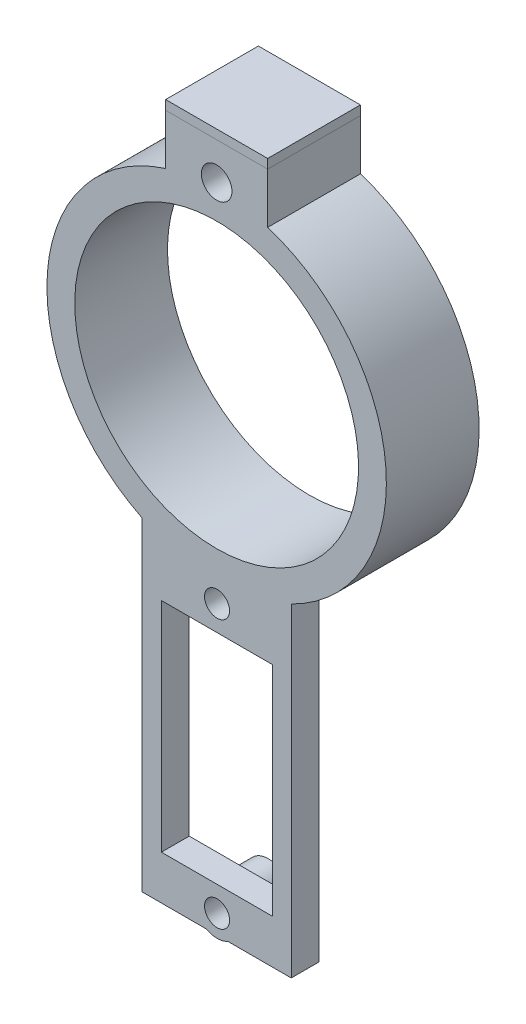
ISO-10303-21;
HEADER;
FILE_DESCRIPTION(('STEP AP214'),'2;1');
FILE_NAME('part.step','',(''),(''),'','','');
FILE_SCHEMA(('AUTOMOTIVE_DESIGN { 1 0 10303 214 1 1 1 1 }'));
ENDSEC;
DATA;
#1=APPLICATION_CONTEXT('core data for automotive mechanical design processes');
#2=APPLICATION_PROTOCOL_DEFINITION('international standard','automotive_design',2000,#1);
#3=PRODUCT_CONTEXT('',#1,'mechanical');
#4=PRODUCT('Part','Part','',(#3));
#5=PRODUCT_RELATED_PRODUCT_CATEGORY('part','',(#4));
#6=PRODUCT_DEFINITION_FORMATION('','',#4);
#7=PRODUCT_DEFINITION_CONTEXT('part definition',#1,'design');
#8=PRODUCT_DEFINITION('design','',#6,#7);
#9=PRODUCT_DEFINITION_SHAPE('','',#8);
#10=(LENGTH_UNIT() NAMED_UNIT(*) SI_UNIT(.MILLI.,.METRE.));
#11=(NAMED_UNIT(*) PLANE_ANGLE_UNIT() SI_UNIT($,.RADIAN.));
#12=(NAMED_UNIT(*) SI_UNIT($,.STERADIAN.) SOLID_ANGLE_UNIT());
#13=UNCERTAINTY_MEASURE_WITH_UNIT(LENGTH_MEASURE(1.E-05),#10,'distance_accuracy_value','');
#14=(GEOMETRIC_REPRESENTATION_CONTEXT(3) GLOBAL_UNCERTAINTY_ASSIGNED_CONTEXT((#13)) GLOBAL_UNIT_ASSIGNED_CONTEXT((#10,
#11,#12)) REPRESENTATION_CONTEXT('',''));
#15=CARTESIAN_POINT('',(0.,0.,0.));
#16=DIRECTION('',(0.,0.,1.));
#17=DIRECTION('',(1.,0.,0.));
#18=AXIS2_PLACEMENT_3D('',#15,#16,#17);
#19=CARTESIAN_POINT('',(5.49999999999999,23.8942942095287,10.));
#20=DIRECTION('',(-1.,0.,0.));
#21=DIRECTION('',(0.,0.,1.));
#22=AXIS2_PLACEMENT_3D('',#19,#20,#21);
#23=PLANE('',#22);
#24=DIRECTION('',(0.,0.,-1.));
#25=VECTOR('',#24,1.);
#26=CARTESIAN_POINT('',(5.49999999999999,22.8942942095287,10.));
#27=LINE('',#26,#25);
#28=CARTESIAN_POINT('',(5.49999999999999,22.8942942095287,10.));
#29=VERTEX_POINT('',#28);
#30=CARTESIAN_POINT('',(5.49999999999999,22.8942942095287,0.));
#31=VERTEX_POINT('',#30);
#32=EDGE_CURVE('E104',#29,#31,#27,.T.);
#33=ORIENTED_EDGE('',*,*,#32,.T.);
#34=DIRECTION('',(0.,-1.,0.));
#35=VECTOR('',#34,1.);
#36=CARTESIAN_POINT('',(5.49999999999999,23.8942942095287,0.));
#37=LINE('',#36,#35);
#38=CARTESIAN_POINT('',(5.49999999999999,23.8942942095287,0.));
#39=VERTEX_POINT('',#38);
#40=EDGE_CURVE('E12',#39,#31,#37,.T.);
#41=ORIENTED_EDGE('',*,*,#40,.F.);
#42=DIRECTION('',(0.,0.,-1.));
#43=VECTOR('',#42,1.);
#44=CARTESIAN_POINT('',(5.49999999999999,23.8942942095287,10.));
#45=LINE('',#44,#43);
#46=CARTESIAN_POINT('',(5.49999999999999,23.8942942095287,10.));
#47=VERTEX_POINT('',#46);
#48=EDGE_CURVE('E92',#47,#39,#45,.T.);
#49=ORIENTED_EDGE('',*,*,#48,.F.);
#50=DIRECTION('',(0.,-1.,0.));
#51=VECTOR('',#50,1.);
#52=CARTESIAN_POINT('',(5.49999999999999,23.8942942095287,10.));
#53=LINE('',#52,#51);
#54=EDGE_CURVE('E100',#47,#29,#53,.T.);
#55=ORIENTED_EDGE('',*,*,#54,.T.);
#56=EDGE_LOOP('',(#33,#41,#49,#55));
#57=FACE_BOUND('',#56,.T.);
#58=ADVANCED_FACE('F41',(#57),#23,.F.);
#59=CARTESIAN_POINT('',(5.49999999999999,23.8942942095287,0.));
#60=DIRECTION('',(0.,0.,1.));
#61=DIRECTION('',(1.,0.,0.));
#62=AXIS2_PLACEMENT_3D('',#59,#60,#61);
#63=PLANE('',#62);
#64=DIRECTION('',(-1.,0.,0.));
#65=VECTOR('',#64,1.);
#66=CARTESIAN_POINT('',(5.49999999999999,22.8942942095287,0.));
#67=LINE('',#66,#65);
#68=CARTESIAN_POINT('',(-5.5,22.8942942095287,0.));
#69=VERTEX_POINT('',#68);
#70=EDGE_CURVE('E96',#31,#69,#67,.T.);
#71=ORIENTED_EDGE('',*,*,#70,.T.);
#72=DIRECTION('',(0.,-1.,0.));
#73=VECTOR('',#72,1.);
#74=CARTESIAN_POINT('',(-5.5,23.8942942095287,0.));
#75=LINE('',#74,#73);
#76=CARTESIAN_POINT('',(-5.5,23.8942942095287,0.));
#77=VERTEX_POINT('',#76);
#78=EDGE_CURVE('E49',#77,#69,#75,.T.);
#79=ORIENTED_EDGE('',*,*,#78,.F.);
#80=DIRECTION('',(-1.,0.,0.));
#81=VECTOR('',#80,1.);
#82=CARTESIAN_POINT('',(5.49999999999999,23.8942942095287,0.));
#83=LINE('',#82,#81);
#84=EDGE_CURVE('E87',#39,#77,#83,.T.);
#85=ORIENTED_EDGE('',*,*,#84,.F.);
#86=ORIENTED_EDGE('',*,*,#40,.T.);
#87=EDGE_LOOP('',(#71,#79,#85,#86));
#88=FACE_BOUND('',#87,.T.);
#89=ADVANCED_FACE('F95',(#88),#63,.F.);
#90=CARTESIAN_POINT('',(-5.5,23.8942942095287,10.));
#91=DIRECTION('',(1.,0.,0.));
#92=DIRECTION('',(0.,0.,-1.));
#93=AXIS2_PLACEMENT_3D('',#90,#91,#92);
#94=PLANE('',#93);
#95=DIRECTION('',(0.,0.,1.));
#96=VECTOR('',#95,1.);
#97=CARTESIAN_POINT('',(-5.5,22.8942942095287,10.));
#98=LINE('',#97,#96);
#99=CARTESIAN_POINT('',(-5.5,22.8942942095287,10.));
#100=VERTEX_POINT('',#99);
#101=EDGE_CURVE('E74',#69,#100,#98,.T.);
#102=ORIENTED_EDGE('',*,*,#101,.T.);
#103=DIRECTION('',(0.,-1.,0.));
#104=VECTOR('',#103,1.);
#105=CARTESIAN_POINT('',(-5.5,23.8942942095287,10.));
#106=LINE('',#105,#104);
#107=CARTESIAN_POINT('',(-5.5,23.8942942095287,10.));
#108=VERTEX_POINT('',#107);
#109=EDGE_CURVE('E97',#108,#100,#106,.T.);
#110=ORIENTED_EDGE('',*,*,#109,.F.);
#111=DIRECTION('',(0.,0.,1.));
#112=VECTOR('',#111,1.);
#113=CARTESIAN_POINT('',(-5.5,23.8942942095287,10.));
#114=LINE('',#113,#112);
#115=EDGE_CURVE('E90',#77,#108,#114,.T.);
#116=ORIENTED_EDGE('',*,*,#115,.F.);
#117=ORIENTED_EDGE('',*,*,#78,.T.);
#118=EDGE_LOOP('',(#102,#110,#116,#117));
#119=FACE_BOUND('',#118,.T.);
#120=ADVANCED_FACE('F98',(#119),#94,.F.);
#121=CARTESIAN_POINT('',(5.49999999999999,23.8942942095287,10.));
#122=DIRECTION('',(0.,0.,-1.));
#123=DIRECTION('',(-1.,0.,0.));
#124=AXIS2_PLACEMENT_3D('',#121,#122,#123);
#125=PLANE('',#124);
#126=DIRECTION('',(1.,0.,0.));
#127=VECTOR('',#126,1.);
#128=CARTESIAN_POINT('',(5.49999999999999,22.8942942095287,10.));
#129=LINE('',#128,#127);
#130=EDGE_CURVE('E80',#100,#29,#129,.T.);
#131=ORIENTED_EDGE('',*,*,#130,.T.);
#132=ORIENTED_EDGE('',*,*,#54,.F.);
#133=DIRECTION('',(1.,0.,0.));
#134=VECTOR('',#133,1.);
#135=CARTESIAN_POINT('',(5.49999999999999,23.8942942095287,10.));
#136=LINE('',#135,#134);
#137=EDGE_CURVE('E57',#108,#47,#136,.T.);
#138=ORIENTED_EDGE('',*,*,#137,.F.);
#139=ORIENTED_EDGE('',*,*,#109,.T.);
#140=EDGE_LOOP('',(#131,#132,#138,#139));
#141=FACE_BOUND('',#140,.T.);
#142=ADVANCED_FACE('F111',(#141),#125,.F.);
#143=CARTESIAN_POINT('',(5.49999999999999,23.8942942095287,0.));
#144=DIRECTION('',(0.,1.,0.));
#145=DIRECTION('',(0.,0.,1.));
#146=AXIS2_PLACEMENT_3D('',#143,#144,#145);
#147=PLANE('',#146);
#148=ORIENTED_EDGE('',*,*,#48,.T.);
#149=ORIENTED_EDGE('',*,*,#84,.T.);
#150=ORIENTED_EDGE('',*,*,#115,.T.);
#151=ORIENTED_EDGE('',*,*,#137,.T.);
#152=EDGE_LOOP('',(#148,#149,#150,#151));
#153=FACE_BOUND('',#152,.T.);
#154=ADVANCED_FACE('F88',(#153),#147,.T.);
#155=CARTESIAN_POINT('',(5.49999999999999,22.8942942095287,0.));
#156=DIRECTION('',(0.,1.,0.));
#157=DIRECTION('',(0.,0.,1.));
#158=AXIS2_PLACEMENT_3D('',#155,#156,#157);
#159=PLANE('',#158);
#160=ORIENTED_EDGE('',*,*,#32,.F.);
#161=ORIENTED_EDGE('',*,*,#130,.F.);
#162=ORIENTED_EDGE('',*,*,#101,.F.);
#163=ORIENTED_EDGE('',*,*,#70,.F.);
#164=EDGE_LOOP('',(#160,#161,#162,#163));
#165=FACE_BOUND('',#164,.T.);
#166=ADVANCED_FACE('F114',(#165),#159,.F.);
#167=CLOSED_SHELL('',(#58,#89,#120,#142,#154,#166));
#168=MANIFOLD_SOLID_BREP('B2',#167);
#169=CARTESIAN_POINT('',(-8.04395604395605,-51.3630681719536,7.));
#170=DIRECTION('',(0.,-1.,0.));
#171=DIRECTION('',(0.,0.,-1.));
#172=AXIS2_PLACEMENT_3D('',#169,#170,#171);
#173=PLANE('',#172);
#174=DIRECTION('',(0.,0.,1.));
#175=VECTOR('',#174,1.);
#176=CARTESIAN_POINT('',(1.19541252552043,-51.3630681719536,4.5));
#177=LINE('',#176,#175);
#178=CARTESIAN_POINT('',(1.19541252552043,-51.3630681719536,7.));
#179=VERTEX_POINT('',#178);
#180=CARTESIAN_POINT('',(1.19541252552043,-51.3630681719536,10.));
#181=VERTEX_POINT('',#180);
#182=EDGE_CURVE('E39',#179,#181,#177,.T.);
#183=ORIENTED_EDGE('',*,*,#182,.F.);
#184=DIRECTION('',(1.,0.,0.));
#185=VECTOR('',#184,1.);
#186=CARTESIAN_POINT('',(-8.04395604395605,-51.3630681719536,7.));
#187=LINE('',#186,#185);
#188=CARTESIAN_POINT('',(8.04395604395605,-51.3630681719536,7.));
#189=VERTEX_POINT('',#188);
#190=EDGE_CURVE('E486',#179,#189,#187,.T.);
#191=ORIENTED_EDGE('',*,*,#190,.T.);
#192=DIRECTION('',(0.,0.,1.));
#193=VECTOR('',#192,1.);
#194=CARTESIAN_POINT('',(8.04395604395605,-51.3630681719536,7.));
#195=LINE('',#194,#193);
#196=CARTESIAN_POINT('',(8.04395604395605,-51.3630681719536,10.));
#197=VERTEX_POINT('',#196);
#198=EDGE_CURVE('E342',#189,#197,#195,.T.);
#199=ORIENTED_EDGE('',*,*,#198,.T.);
#200=DIRECTION('',(1.,0.,0.));
#201=VECTOR('',#200,1.);
#202=CARTESIAN_POINT('',(-8.04395604395605,-51.3630681719536,10.));
#203=LINE('',#202,#201);
#204=EDGE_CURVE('E328',#181,#197,#203,.T.);
#205=ORIENTED_EDGE('',*,*,#204,.F.);
#206=EDGE_LOOP('',(#183,#191,#199,#205));
#207=FACE_BOUND('',#206,.T.);
#208=ADVANCED_FACE('F165',(#207),#173,.T.);
#209=CARTESIAN_POINT('',(0.,0.,10.));
#210=DIRECTION('',(0.,0.,-1.));
#211=DIRECTION('',(-1.,0.,0.));
#212=AXIS2_PLACEMENT_3D('',#209,#210,#211);
#213=CYLINDRICAL_SURFACE('',#212,18.3);
#214=CARTESIAN_POINT('',(0.,0.,4.5));
#215=DIRECTION('',(0.,0.,1.));
#216=DIRECTION('',(1.,0.,0.));
#217=AXIS2_PLACEMENT_3D('',#214,#215,#216);
#218=CIRCLE('',#217,18.3);
#219=CARTESIAN_POINT('',(-0.933853262683011,-18.2761570928841,4.5));
#220=VERTEX_POINT('',#219);
#221=CARTESIAN_POINT('',(1.01255338187159,-18.2719658397464,4.5));
#222=VERTEX_POINT('',#221);
#223=EDGE_CURVE('E322',#220,#222,#218,.T.);
#224=ORIENTED_EDGE('',*,*,#223,.F.);
#225=DIRECTION('',(0.,0.,1.));
#226=VECTOR('',#225,1.);
#227=CARTESIAN_POINT('',(-0.933853262683006,-18.2761570928841,7.25));
#228=LINE('',#227,#226);
#229=CARTESIAN_POINT('',(-0.933853262683004,-18.2761570928841,7.));
#230=VERTEX_POINT('',#229);
#231=EDGE_CURVE('E385',#220,#230,#228,.T.);
#232=ORIENTED_EDGE('',*,*,#231,.T.);
#233=CARTESIAN_POINT('',(0.,0.,7.));
#234=DIRECTION('',(0.,0.,1.));
#235=DIRECTION('',(1.,0.,0.));
#236=AXIS2_PLACEMENT_3D('',#233,#234,#235);
#237=CIRCLE('',#236,18.3);
#238=CARTESIAN_POINT('',(-8.04395604395604,-16.4372981710165,7.));
#239=VERTEX_POINT('',#238);
#240=EDGE_CURVE('E360',#239,#230,#237,.T.);
#241=ORIENTED_EDGE('',*,*,#240,.F.);
#242=DIRECTION('',(0.,0.,1.));
#243=VECTOR('',#242,1.);
#244=CARTESIAN_POINT('',(-8.04395604395604,-16.4372981710165,7.));
#245=LINE('',#244,#243);
#246=CARTESIAN_POINT('',(-8.04395604395604,-16.4372981710165,10.));
#247=VERTEX_POINT('',#246);
#248=EDGE_CURVE('E335',#239,#247,#245,.T.);
#249=ORIENTED_EDGE('',*,*,#248,.T.);
#250=CARTESIAN_POINT('',(0.,0.,10.));
#251=DIRECTION('',(0.,0.,1.));
#252=DIRECTION('',(1.,0.,0.));
#253=AXIS2_PLACEMENT_3D('',#250,#251,#252);
#254=CIRCLE('',#253,18.3);
#255=CARTESIAN_POINT('',(-5.5,17.4539393834171,10.));
#256=VERTEX_POINT('',#255);
#257=EDGE_CURVE('E358',#256,#247,#254,.T.);
#258=ORIENTED_EDGE('',*,*,#257,.F.);
#259=DIRECTION('',(0.,0.,-1.));
#260=VECTOR('',#259,1.);
#261=CARTESIAN_POINT('',(-5.5,17.4539393834171,10.));
#262=LINE('',#261,#260);
#263=CARTESIAN_POINT('',(-5.5,17.4539393834171,0.));
#264=VERTEX_POINT('',#263);
#265=EDGE_CURVE('E440',#256,#264,#262,.T.);
#266=ORIENTED_EDGE('',*,*,#265,.T.);
#267=CARTESIAN_POINT('',(0.,0.,0.));
#268=DIRECTION('',(0.,0.,1.));
#269=DIRECTION('',(1.,0.,0.));
#270=AXIS2_PLACEMENT_3D('',#267,#268,#269);
#271=CIRCLE('',#270,18.3);
#272=CARTESIAN_POINT('',(5.5,17.4539393834171,0.));
#273=VERTEX_POINT('',#272);
#274=EDGE_CURVE('E351',#264,#273,#271,.T.);
#275=ORIENTED_EDGE('',*,*,#274,.T.);
#276=DIRECTION('',(0.,0.,-1.));
#277=VECTOR('',#276,1.);
#278=CARTESIAN_POINT('',(5.5,17.4539393834171,10.));
#279=LINE('',#278,#277);
#280=CARTESIAN_POINT('',(5.5,17.4539393834171,10.));
#281=VERTEX_POINT('',#280);
#282=EDGE_CURVE('E416',#281,#273,#279,.T.);
#283=ORIENTED_EDGE('',*,*,#282,.F.);
#284=CARTESIAN_POINT('',(8.04395604395603,-16.4372981710165,10.));
#285=VERTEX_POINT('',#284);
#286=EDGE_CURVE('E354',#285,#281,#254,.T.);
#287=ORIENTED_EDGE('',*,*,#286,.F.);
#288=DIRECTION('',(0.,0.,1.));
#289=VECTOR('',#288,1.);
#290=CARTESIAN_POINT('',(8.04395604395604,-16.4372981710165,7.));
#291=LINE('',#290,#289);
#292=CARTESIAN_POINT('',(8.04395604395604,-16.4372981710165,7.));
#293=VERTEX_POINT('',#292);
#294=EDGE_CURVE('E339',#293,#285,#291,.T.);
#295=ORIENTED_EDGE('',*,*,#294,.F.);
#296=CARTESIAN_POINT('',(1.01255338187159,-18.2719658397464,7.));
#297=VERTEX_POINT('',#296);
#298=EDGE_CURVE('E357',#297,#293,#237,.T.);
#299=ORIENTED_EDGE('',*,*,#298,.F.);
#300=DIRECTION('',(0.,0.,1.));
#301=VECTOR('',#300,1.);
#302=CARTESIAN_POINT('',(1.01255338187159,-18.2719658397464,7.25));
#303=LINE('',#302,#301);
#304=EDGE_CURVE('E187',#297,#222,#303,.F.);
#305=ORIENTED_EDGE('',*,*,#304,.T.);
#306=EDGE_LOOP('',(#224,#232,#241,#249,#258,#266,#275,#283,#287,#295,#299,#305));
#307=FACE_BOUND('',#306,.T.);
#308=ADVANCED_FACE('F167',(#307),#213,.T.);
#309=CARTESIAN_POINT('',(3.5,18.3,10.));
#310=DIRECTION('',(1.,0.,0.));
#311=DIRECTION('',(0.,1.,0.));
#312=AXIS2_PLACEMENT_3D('',#309,#310,#311);
#313=PLANE('',#312);
#314=DIRECTION('',(0.,0.,-1.));
#315=VECTOR('',#314,1.);
#316=CARTESIAN_POINT('',(3.5,14.8942942095287,10.));
#317=LINE('',#316,#315);
#318=CARTESIAN_POINT('',(3.50000000000001,14.8942942095287,10.));
#319=VERTEX_POINT('',#318);
#320=CARTESIAN_POINT('',(3.5,14.8942942095287,0.));
#321=VERTEX_POINT('',#320);
#322=EDGE_CURVE('E447',#319,#321,#317,.T.);
#323=ORIENTED_EDGE('',*,*,#322,.F.);
#324=DIRECTION('',(0.,0.624695047554424,-0.78086880944303));
#325=VECTOR('',#324,1.);
#326=CARTESIAN_POINT('',(3.5,14.8942942095287,10.));
#327=LINE('',#326,#325);
#328=CARTESIAN_POINT('',(3.5,22.8942942095287,0.));
#329=VERTEX_POINT('',#328);
#330=EDGE_CURVE('E422',#319,#329,#327,.T.);
#331=ORIENTED_EDGE('',*,*,#330,.T.);
#332=DIRECTION('',(0.,-1.,0.));
#333=VECTOR('',#332,1.);
#334=CARTESIAN_POINT('',(3.5,18.3,0.));
#335=LINE('',#334,#333);
#336=EDGE_CURVE('E442',#329,#321,#335,.T.);
#337=ORIENTED_EDGE('',*,*,#336,.T.);
#338=EDGE_LOOP('',(#323,#331,#337));
#339=FACE_BOUND('',#338,.T.);
#340=ADVANCED_FACE('F518',(#339),#313,.F.);
#341=CARTESIAN_POINT('',(-3.5,18.3,10.));
#342=DIRECTION('',(-1.,0.,0.));
#343=DIRECTION('',(0.,-1.,0.));
#344=AXIS2_PLACEMENT_3D('',#341,#342,#343);
#345=PLANE('',#344);
#346=DIRECTION('',(0.,0.624695047554424,-0.78086880944303));
#347=VECTOR('',#346,1.);
#348=CARTESIAN_POINT('',(-3.5,14.8942942095287,10.));
#349=LINE('',#348,#347);
#350=CARTESIAN_POINT('',(-3.5,14.8942942095287,10.));
#351=VERTEX_POINT('',#350);
#352=CARTESIAN_POINT('',(-3.5,22.8942942095287,0.));
#353=VERTEX_POINT('',#352);
#354=EDGE_CURVE('E419',#351,#353,#349,.T.);
#355=ORIENTED_EDGE('',*,*,#354,.F.);
#356=DIRECTION('',(0.,0.,-1.));
#357=VECTOR('',#356,1.);
#358=CARTESIAN_POINT('',(-3.5,14.8942942095287,10.));
#359=LINE('',#358,#357);
#360=CARTESIAN_POINT('',(-3.5,14.8942942095287,0.));
#361=VERTEX_POINT('',#360);
#362=EDGE_CURVE('E448',#351,#361,#359,.T.);
#363=ORIENTED_EDGE('',*,*,#362,.T.);
#364=DIRECTION('',(0.,1.,0.));
#365=VECTOR('',#364,1.);
#366=CARTESIAN_POINT('',(-3.5,18.3,0.));
#367=LINE('',#366,#365);
#368=EDGE_CURVE('E444',#361,#353,#367,.T.);
#369=ORIENTED_EDGE('',*,*,#368,.T.);
#370=EDGE_LOOP('',(#355,#363,#369));
#371=FACE_BOUND('',#370,.T.);
#372=ADVANCED_FACE('F527',(#371),#345,.F.);
#373=CARTESIAN_POINT('',(0.,0.,10.));
#374=DIRECTION('',(0.,0.,1.));
#375=DIRECTION('',(1.,0.,0.));
#376=AXIS2_PLACEMENT_3D('',#373,#374,#375);
#377=PLANE('',#376);
#378=CARTESIAN_POINT('',(0.043956043956039,-20.4130681719536,10.));
#379=DIRECTION('',(0.,0.,1.));
#380=DIRECTION('',(1.,0.,0.));
#381=AXIS2_PLACEMENT_3D('',#378,#379,#380);
#382=CIRCLE('',#381,1.35);
#383=CARTESIAN_POINT('',(1.39395604395604,-20.4130681719536,10.));
#384=VERTEX_POINT('',#383);
#385=EDGE_CURVE('E547',#384,#384,#382,.T.);
#386=ORIENTED_EDGE('',*,*,#385,.F.);
#387=EDGE_LOOP('',(#386));
#388=FACE_BOUND('',#387,.T.);
#389=CARTESIAN_POINT('',(0.0465021382288992,-49.3130669714726,10.));
#390=DIRECTION('',(0.,0.,1.));
#391=DIRECTION('',(1.,0.,0.));
#392=AXIS2_PLACEMENT_3D('',#389,#390,#391);
#393=CIRCLE('',#392,1.35);
#394=CARTESIAN_POINT('',(1.3965021382289,-49.3130669714726,10.));
#395=VERTEX_POINT('',#394);
#396=EDGE_CURVE('E541',#395,#395,#393,.T.);
#397=ORIENTED_EDGE('',*,*,#396,.F.);
#398=EDGE_LOOP('',(#397));
#399=FACE_BOUND('',#398,.T.);
#400=CARTESIAN_POINT('',(-8.04395604395605,-51.3630681719536,10.));
#401=VERTEX_POINT('',#400);
#402=CARTESIAN_POINT('',(-1.10240824906264,-51.3630681719536,10.));
#403=VERTEX_POINT('',#402);
#404=EDGE_CURVE('E318',#401,#403,#203,.T.);
#405=ORIENTED_EDGE('',*,*,#404,.T.);
#406=CARTESIAN_POINT('',(0.0465021382288992,-49.3130669714726,10.));
#407=DIRECTION('',(0.,0.,1.));
#408=DIRECTION('',(1.,0.,0.));
#409=AXIS2_PLACEMENT_3D('',#406,#407,#408);
#410=CIRCLE('',#409,2.35);
#411=EDGE_CURVE('E180',#403,#181,#410,.T.);
#412=ORIENTED_EDGE('',*,*,#411,.T.);
#413=ORIENTED_EDGE('',*,*,#204,.T.);
#414=DIRECTION('',(0.,1.,0.));
#415=VECTOR('',#414,1.);
#416=CARTESIAN_POINT('',(8.04395604395605,-51.3630681719536,10.));
#417=LINE('',#416,#415);
#418=EDGE_CURVE('E327',#197,#285,#417,.T.);
#419=ORIENTED_EDGE('',*,*,#418,.T.);
#420=ORIENTED_EDGE('',*,*,#286,.T.);
#421=DIRECTION('',(0.,-1.,0.));
#422=VECTOR('',#421,1.);
#423=CARTESIAN_POINT('',(5.5,22.8942942095287,10.));
#424=LINE('',#423,#422);
#425=CARTESIAN_POINT('',(5.5,22.8942942095287,10.));
#426=VERTEX_POINT('',#425);
#427=EDGE_CURVE('E410',#426,#281,#424,.T.);
#428=ORIENTED_EDGE('',*,*,#427,.F.);
#429=DIRECTION('',(1.,0.,0.));
#430=VECTOR('',#429,1.);
#431=CARTESIAN_POINT('',(-5.5,22.8942942095287,10.));
#432=LINE('',#431,#430);
#433=CARTESIAN_POINT('',(-5.5,22.8942942095287,10.));
#434=VERTEX_POINT('',#433);
#435=EDGE_CURVE('E438',#434,#426,#432,.T.);
#436=ORIENTED_EDGE('',*,*,#435,.F.);
#437=DIRECTION('',(0.,1.,0.));
#438=VECTOR('',#437,1.);
#439=CARTESIAN_POINT('',(-5.5,22.8942942095287,10.));
#440=LINE('',#439,#438);
#441=EDGE_CURVE('E431',#256,#434,#440,.T.);
#442=ORIENTED_EDGE('',*,*,#441,.F.);
#443=ORIENTED_EDGE('',*,*,#257,.T.);
#444=DIRECTION('',(0.,-1.,0.));
#445=VECTOR('',#444,1.);
#446=CARTESIAN_POINT('',(-8.04395604395604,-16.4372981710165,10.));
#447=LINE('',#446,#445);
#448=EDGE_CURVE('E326',#247,#401,#447,.T.);
#449=ORIENTED_EDGE('',*,*,#448,.T.);
#450=EDGE_LOOP('',(#405,#412,#413,#419,#420,#428,#436,#442,#443,#449));
#451=FACE_BOUND('',#450,.T.);
#452=CARTESIAN_POINT('',(0.,0.,10.));
#453=DIRECTION('',(0.,0.,-1.));
#454=DIRECTION('',(-1.,0.,0.));
#455=AXIS2_PLACEMENT_3D('',#452,#453,#454);
#456=CIRCLE('',#455,15.3);
#457=EDGE_CURVE('E391',#351,#319,#456,.T.);
#458=ORIENTED_EDGE('',*,*,#457,.T.);
#459=CARTESIAN_POINT('',(0.,0.,10.));
#460=DIRECTION('',(0.,0.,1.));
#461=DIRECTION('',(1.,0.,0.));
#462=AXIS2_PLACEMENT_3D('',#459,#460,#461);
#463=CIRCLE('',#462,15.3);
#464=EDGE_CURVE('E348',#351,#319,#463,.T.);
#465=ORIENTED_EDGE('',*,*,#464,.F.);
#466=EDGE_LOOP('',(#458,#465));
#467=FACE_BOUND('',#466,.T.);
#468=CARTESIAN_POINT('',(0.,18.8942942095287,10.));
#469=DIRECTION('',(0.,0.,1.));
#470=DIRECTION('',(1.,0.,0.));
#471=AXIS2_PLACEMENT_3D('',#468,#469,#470);
#472=CIRCLE('',#471,1.65);
#473=CARTESIAN_POINT('',(1.64999999999999,18.8942942095287,10.));
#474=VERTEX_POINT('',#473);
#475=EDGE_CURVE('E400',#474,#474,#472,.T.);
#476=ORIENTED_EDGE('',*,*,#475,.F.);
#477=EDGE_LOOP('',(#476));
#478=FACE_BOUND('',#477,.T.);
#479=DIRECTION('',(0.,1.,0.));
#480=VECTOR('',#479,1.);
#481=CARTESIAN_POINT('',(6.04395604395604,-23.1130681719536,10.));
#482=LINE('',#481,#480);
#483=CARTESIAN_POINT('',(6.04395604395604,-46.6130681719536,10.));
#484=VERTEX_POINT('',#483);
#485=CARTESIAN_POINT('',(6.04395604395604,-23.1130681719536,10.));
#486=VERTEX_POINT('',#485);
#487=EDGE_CURVE('E450',#484,#486,#482,.T.);
#488=ORIENTED_EDGE('',*,*,#487,.F.);
#489=DIRECTION('',(1.,0.,0.));
#490=VECTOR('',#489,1.);
#491=CARTESIAN_POINT('',(-5.95604395604396,-46.6130681719536,10.));
#492=LINE('',#491,#490);
#493=CARTESIAN_POINT('',(-5.95604395604396,-46.6130681719536,10.));
#494=VERTEX_POINT('',#493);
#495=EDGE_CURVE('E457',#494,#484,#492,.T.);
#496=ORIENTED_EDGE('',*,*,#495,.F.);
#497=DIRECTION('',(0.,-1.,0.));
#498=VECTOR('',#497,1.);
#499=CARTESIAN_POINT('',(-5.95604395604396,-23.1130681719536,10.));
#500=LINE('',#499,#498);
#501=CARTESIAN_POINT('',(-5.95604395604396,-23.1130681719536,10.));
#502=VERTEX_POINT('',#501);
#503=EDGE_CURVE('E471',#502,#494,#500,.T.);
#504=ORIENTED_EDGE('',*,*,#503,.F.);
#505=DIRECTION('',(-1.,0.,0.));
#506=VECTOR('',#505,1.);
#507=CARTESIAN_POINT('',(-5.95604395604396,-23.1130681719536,10.));
#508=LINE('',#507,#506);
#509=EDGE_CURVE('E468',#486,#502,#508,.T.);
#510=ORIENTED_EDGE('',*,*,#509,.F.);
#511=EDGE_LOOP('',(#488,#496,#504,#510));
#512=FACE_BOUND('',#511,.T.);
#513=ADVANCED_FACE('F323',(#388,#399,#451,#467,#478,#512),#377,.T.);
#514=CARTESIAN_POINT('',(0.,0.,0.));
#515=DIRECTION('',(0.,0.,1.));
#516=DIRECTION('',(1.,0.,0.));
#517=AXIS2_PLACEMENT_3D('',#514,#515,#516);
#518=PLANE('',#517);
#519=CARTESIAN_POINT('',(0.,0.,0.));
#520=DIRECTION('',(0.,0.,1.));
#521=DIRECTION('',(1.,0.,0.));
#522=AXIS2_PLACEMENT_3D('',#519,#520,#521);
#523=CIRCLE('',#522,15.3);
#524=EDGE_CURVE('E338',#361,#321,#523,.T.);
#525=ORIENTED_EDGE('',*,*,#524,.T.);
#526=ORIENTED_EDGE('',*,*,#336,.F.);
#527=DIRECTION('',(-1.,0.,0.));
#528=VECTOR('',#527,1.);
#529=CARTESIAN_POINT('',(5.5,22.8942942095287,0.));
#530=LINE('',#529,#528);
#531=CARTESIAN_POINT('',(5.5,22.8942942095287,0.));
#532=VERTEX_POINT('',#531);
#533=EDGE_CURVE('E413',#532,#329,#530,.T.);
#534=ORIENTED_EDGE('',*,*,#533,.F.);
#535=DIRECTION('',(0.,1.,0.));
#536=VECTOR('',#535,1.);
#537=CARTESIAN_POINT('',(5.5,22.8942942095287,0.));
#538=LINE('',#537,#536);
#539=EDGE_CURVE('E403',#273,#532,#538,.T.);
#540=ORIENTED_EDGE('',*,*,#539,.F.);
#541=ORIENTED_EDGE('',*,*,#274,.F.);
#542=DIRECTION('',(0.,-1.,0.));
#543=VECTOR('',#542,1.);
#544=CARTESIAN_POINT('',(-5.5,22.8942942095287,0.));
#545=LINE('',#544,#543);
#546=CARTESIAN_POINT('',(-5.5,22.8942942095287,0.));
#547=VERTEX_POINT('',#546);
#548=EDGE_CURVE('E428',#547,#264,#545,.T.);
#549=ORIENTED_EDGE('',*,*,#548,.F.);
#550=DIRECTION('',(1.,0.,0.));
#551=VECTOR('',#550,1.);
#552=CARTESIAN_POINT('',(-5.5,22.8942942095287,0.));
#553=LINE('',#552,#551);
#554=EDGE_CURVE('E435',#547,#353,#553,.T.);
#555=ORIENTED_EDGE('',*,*,#554,.T.);
#556=ORIENTED_EDGE('',*,*,#368,.F.);
#557=EDGE_LOOP('',(#525,#526,#534,#540,#541,#549,#555,#556));
#558=FACE_BOUND('',#557,.T.);
#559=ADVANCED_FACE('F507',(#558),#518,.F.);
#560=CARTESIAN_POINT('',(0.,0.,10.));
#561=DIRECTION('',(0.,0.,-1.));
#562=DIRECTION('',(-1.,0.,0.));
#563=AXIS2_PLACEMENT_3D('',#560,#561,#562);
#564=CYLINDRICAL_SURFACE('',#563,15.3);
#565=ORIENTED_EDGE('',*,*,#362,.F.);
#566=ORIENTED_EDGE('',*,*,#464,.T.);
#567=ORIENTED_EDGE('',*,*,#322,.T.);
#568=ORIENTED_EDGE('',*,*,#524,.F.);
#569=EDGE_LOOP('',(#565,#566,#567,#568));
#570=FACE_BOUND('',#569,.T.);
#571=ADVANCED_FACE('F521',(#570),#564,.F.);
#572=CARTESIAN_POINT('',(-8.04395604395605,-51.3630681719536,7.));
#573=DIRECTION('',(0.,0.,1.));
#574=DIRECTION('',(1.,0.,0.));
#575=AXIS2_PLACEMENT_3D('',#572,#573,#574);
#576=PLANE('',#575);
#577=DIRECTION('',(1.,0.,0.));
#578=VECTOR('',#577,1.);
#579=CARTESIAN_POINT('',(-5.95604395604396,-46.6130681719536,7.));
#580=LINE('',#579,#578);
#581=CARTESIAN_POINT('',(-5.95604395604396,-46.6130681719536,7.));
#582=VERTEX_POINT('',#581);
#583=CARTESIAN_POINT('',(6.04395604395604,-46.6130681719536,7.));
#584=VERTEX_POINT('',#583);
#585=EDGE_CURVE('E463',#582,#584,#580,.T.);
#586=ORIENTED_EDGE('',*,*,#585,.T.);
#587=DIRECTION('',(0.,1.,0.));
#588=VECTOR('',#587,1.);
#589=CARTESIAN_POINT('',(6.04395604395604,-23.1130681719536,7.));
#590=LINE('',#589,#588);
#591=CARTESIAN_POINT('',(6.04395604395604,-23.1130681719536,7.));
#592=VERTEX_POINT('',#591);
#593=EDGE_CURVE('E453',#584,#592,#590,.T.);
#594=ORIENTED_EDGE('',*,*,#593,.T.);
#595=DIRECTION('',(-1.,0.,0.));
#596=VECTOR('',#595,1.);
#597=CARTESIAN_POINT('',(-5.95604395604396,-23.1130681719536,7.));
#598=LINE('',#597,#596);
#599=CARTESIAN_POINT('',(-5.95604395604396,-23.1130681719536,7.));
#600=VERTEX_POINT('',#599);
#601=EDGE_CURVE('E456',#592,#600,#598,.T.);
#602=ORIENTED_EDGE('',*,*,#601,.T.);
#603=DIRECTION('',(0.,-1.,0.));
#604=VECTOR('',#603,1.);
#605=CARTESIAN_POINT('',(-5.95604395604396,-23.1130681719536,7.));
#606=LINE('',#605,#604);
#607=EDGE_CURVE('E460',#600,#582,#606,.T.);
#608=ORIENTED_EDGE('',*,*,#607,.T.);
#609=EDGE_LOOP('',(#586,#594,#602,#608));
#610=FACE_BOUND('',#609,.T.);
#611=ORIENTED_EDGE('',*,*,#190,.F.);
#612=CARTESIAN_POINT('',(0.0465021382288992,-49.3130669714726,7.));
#613=DIRECTION('',(0.,0.,1.));
#614=DIRECTION('',(1.,0.,0.));
#615=AXIS2_PLACEMENT_3D('',#612,#613,#614);
#616=CIRCLE('',#615,2.35);
#617=CARTESIAN_POINT('',(-1.10240824906264,-51.3630681719536,7.));
#618=VERTEX_POINT('',#617);
#619=EDGE_CURVE('E386',#179,#618,#616,.T.);
#620=ORIENTED_EDGE('',*,*,#619,.T.);
#621=CARTESIAN_POINT('',(-8.04395604395605,-51.3630681719536,7.));
#622=VERTEX_POINT('',#621);
#623=EDGE_CURVE('E321',#622,#618,#187,.T.);
#624=ORIENTED_EDGE('',*,*,#623,.F.);
#625=DIRECTION('',(0.,-1.,0.));
#626=VECTOR('',#625,1.);
#627=CARTESIAN_POINT('',(-8.04395604395604,-16.4372981710165,7.));
#628=LINE('',#627,#626);
#629=EDGE_CURVE('E330',#239,#622,#628,.T.);
#630=ORIENTED_EDGE('',*,*,#629,.F.);
#631=ORIENTED_EDGE('',*,*,#240,.T.);
#632=CARTESIAN_POINT('',(0.043956043956039,-20.4130681719536,7.));
#633=DIRECTION('',(0.,0.,1.));
#634=DIRECTION('',(1.,0.,0.));
#635=AXIS2_PLACEMENT_3D('',#632,#633,#634);
#636=CIRCLE('',#635,2.35);
#637=EDGE_CURVE('E375',#230,#297,#636,.T.);
#638=ORIENTED_EDGE('',*,*,#637,.T.);
#639=ORIENTED_EDGE('',*,*,#298,.T.);
#640=DIRECTION('',(0.,1.,0.));
#641=VECTOR('',#640,1.);
#642=CARTESIAN_POINT('',(8.04395604395605,-51.3630681719536,7.));
#643=LINE('',#642,#641);
#644=EDGE_CURVE('E347',#189,#293,#643,.T.);
#645=ORIENTED_EDGE('',*,*,#644,.F.);
#646=EDGE_LOOP('',(#611,#620,#624,#630,#631,#638,#639,#645));
#647=FACE_BOUND('',#646,.T.);
#648=ADVANCED_FACE('F537',(#610,#647),#576,.F.);
#649=CARTESIAN_POINT('',(-8.04395604395604,-16.4372981710165,7.));
#650=DIRECTION('',(-1.,0.,0.));
#651=DIRECTION('',(0.,-1.,0.));
#652=AXIS2_PLACEMENT_3D('',#649,#650,#651);
#653=PLANE('',#652);
#654=ORIENTED_EDGE('',*,*,#448,.F.);
#655=ORIENTED_EDGE('',*,*,#248,.F.);
#656=ORIENTED_EDGE('',*,*,#629,.T.);
#657=DIRECTION('',(0.,0.,1.));
#658=VECTOR('',#657,1.);
#659=CARTESIAN_POINT('',(-8.04395604395605,-51.3630681719536,7.));
#660=LINE('',#659,#658);
#661=EDGE_CURVE('E345',#622,#401,#660,.T.);
#662=ORIENTED_EDGE('',*,*,#661,.T.);
#663=EDGE_LOOP('',(#654,#655,#656,#662));
#664=FACE_BOUND('',#663,.T.);
#665=ADVANCED_FACE('F534',(#664),#653,.T.);
#666=CARTESIAN_POINT('',(8.04395604395605,-51.3630681719536,7.));
#667=DIRECTION('',(1.,0.,0.));
#668=DIRECTION('',(0.,1.,0.));
#669=AXIS2_PLACEMENT_3D('',#666,#667,#668);
#670=PLANE('',#669);
#671=ORIENTED_EDGE('',*,*,#418,.F.);
#672=ORIENTED_EDGE('',*,*,#198,.F.);
#673=ORIENTED_EDGE('',*,*,#644,.T.);
#674=ORIENTED_EDGE('',*,*,#294,.T.);
#675=EDGE_LOOP('',(#671,#672,#673,#674));
#676=FACE_BOUND('',#675,.T.);
#677=ADVANCED_FACE('F492',(#676),#670,.T.);
#678=DIRECTION('',(0.,0.,1.));
#679=VECTOR('',#678,1.);
#680=CARTESIAN_POINT('',(-1.10240824906264,-51.3630681719536,4.5));
#681=LINE('',#680,#679);
#682=EDGE_CURVE('E173',#403,#618,#681,.F.);
#683=ORIENTED_EDGE('',*,*,#682,.F.);
#684=ORIENTED_EDGE('',*,*,#404,.F.);
#685=ORIENTED_EDGE('',*,*,#661,.F.);
#686=ORIENTED_EDGE('',*,*,#623,.T.);
#687=EDGE_LOOP('',(#683,#684,#685,#686));
#688=FACE_BOUND('',#687,.T.);
#689=ADVANCED_FACE('F317',(#688),#173,.T.);
#690=CARTESIAN_POINT('',(6.04395604395604,-23.1130681719536,7.));
#691=DIRECTION('',(1.,0.,0.));
#692=DIRECTION('',(0.,1.,0.));
#693=AXIS2_PLACEMENT_3D('',#690,#691,#692);
#694=PLANE('',#693);
#695=ORIENTED_EDGE('',*,*,#487,.T.);
#696=DIRECTION('',(0.,0.,1.));
#697=VECTOR('',#696,1.);
#698=CARTESIAN_POINT('',(6.04395604395604,-23.1130681719536,7.));
#699=LINE('',#698,#697);
#700=EDGE_CURVE('E466',#592,#486,#699,.T.);
#701=ORIENTED_EDGE('',*,*,#700,.F.);
#702=ORIENTED_EDGE('',*,*,#593,.F.);
#703=DIRECTION('',(0.,0.,1.));
#704=VECTOR('',#703,1.);
#705=CARTESIAN_POINT('',(6.04395604395604,-46.6130681719536,7.));
#706=LINE('',#705,#704);
#707=EDGE_CURVE('E476',#584,#484,#706,.T.);
#708=ORIENTED_EDGE('',*,*,#707,.T.);
#709=EDGE_LOOP('',(#695,#701,#702,#708));
#710=FACE_BOUND('',#709,.T.);
#711=ADVANCED_FACE('F590',(#710),#694,.F.);
#712=CARTESIAN_POINT('',(-5.95604395604396,-46.6130681719536,7.));
#713=DIRECTION('',(0.,-1.,0.));
#714=DIRECTION('',(0.,0.,-1.));
#715=AXIS2_PLACEMENT_3D('',#712,#713,#714);
#716=PLANE('',#715);
#717=ORIENTED_EDGE('',*,*,#495,.T.);
#718=ORIENTED_EDGE('',*,*,#707,.F.);
#719=ORIENTED_EDGE('',*,*,#585,.F.);
#720=DIRECTION('',(0.,0.,1.));
#721=VECTOR('',#720,1.);
#722=CARTESIAN_POINT('',(-5.95604395604396,-46.6130681719536,7.));
#723=LINE('',#722,#721);
#724=EDGE_CURVE('E478',#582,#494,#723,.T.);
#725=ORIENTED_EDGE('',*,*,#724,.T.);
#726=EDGE_LOOP('',(#717,#718,#719,#725));
#727=FACE_BOUND('',#726,.T.);
#728=ADVANCED_FACE('F595',(#727),#716,.F.);
#729=CARTESIAN_POINT('',(-5.95604395604396,-23.1130681719536,7.));
#730=DIRECTION('',(-1.,0.,0.));
#731=DIRECTION('',(0.,-1.,0.));
#732=AXIS2_PLACEMENT_3D('',#729,#730,#731);
#733=PLANE('',#732);
#734=ORIENTED_EDGE('',*,*,#503,.T.);
#735=ORIENTED_EDGE('',*,*,#724,.F.);
#736=ORIENTED_EDGE('',*,*,#607,.F.);
#737=DIRECTION('',(0.,0.,1.));
#738=VECTOR('',#737,1.);
#739=CARTESIAN_POINT('',(-5.95604395604396,-23.1130681719536,7.));
#740=LINE('',#739,#738);
#741=EDGE_CURVE('E480',#600,#502,#740,.T.);
#742=ORIENTED_EDGE('',*,*,#741,.T.);
#743=EDGE_LOOP('',(#734,#735,#736,#742));
#744=FACE_BOUND('',#743,.T.);
#745=ADVANCED_FACE('F608',(#744),#733,.F.);
#746=CARTESIAN_POINT('',(-5.95604395604396,-23.1130681719536,7.));
#747=DIRECTION('',(0.,1.,0.));
#748=DIRECTION('',(0.,0.,1.));
#749=AXIS2_PLACEMENT_3D('',#746,#747,#748);
#750=PLANE('',#749);
#751=ORIENTED_EDGE('',*,*,#509,.T.);
#752=ORIENTED_EDGE('',*,*,#741,.F.);
#753=ORIENTED_EDGE('',*,*,#601,.F.);
#754=ORIENTED_EDGE('',*,*,#700,.T.);
#755=EDGE_LOOP('',(#751,#752,#753,#754));
#756=FACE_BOUND('',#755,.T.);
#757=ADVANCED_FACE('F605',(#756),#750,.F.);
#758=CARTESIAN_POINT('',(-5.5,14.8942942095287,0.));
#759=DIRECTION('',(-1.,0.,0.));
#760=DIRECTION('',(0.,0.,1.));
#761=AXIS2_PLACEMENT_3D('',#758,#759,#760);
#762=PLANE('',#761);
#763=ORIENTED_EDGE('',*,*,#265,.F.);
#764=ORIENTED_EDGE('',*,*,#441,.T.);
#765=DIRECTION('',(0.,0.,-1.));
#766=VECTOR('',#765,1.);
#767=CARTESIAN_POINT('',(-5.5,22.8942942095287,0.));
#768=LINE('',#767,#766);
#769=EDGE_CURVE('E433',#434,#547,#768,.T.);
#770=ORIENTED_EDGE('',*,*,#769,.T.);
#771=ORIENTED_EDGE('',*,*,#548,.T.);
#772=EDGE_LOOP('',(#763,#764,#770,#771));
#773=FACE_BOUND('',#772,.T.);
#774=ADVANCED_FACE('F531',(#773),#762,.T.);
#775=CARTESIAN_POINT('',(-5.5,22.8942942095287,0.));
#776=DIRECTION('',(0.,-1.,0.));
#777=DIRECTION('',(0.,0.,-1.));
#778=AXIS2_PLACEMENT_3D('',#775,#776,#777);
#779=PLANE('',#778);
#780=ORIENTED_EDGE('',*,*,#435,.T.);
#781=DIRECTION('',(0.,0.,1.));
#782=VECTOR('',#781,1.);
#783=CARTESIAN_POINT('',(5.5,22.8942942095287,0.));
#784=LINE('',#783,#782);
#785=EDGE_CURVE('E407',#532,#426,#784,.T.);
#786=ORIENTED_EDGE('',*,*,#785,.F.);
#787=ORIENTED_EDGE('',*,*,#533,.T.);
#788=DIRECTION('',(1.,0.,0.));
#789=VECTOR('',#788,1.);
#790=CARTESIAN_POINT('',(-3.5,22.8942942095287,0.));
#791=LINE('',#790,#789);
#792=EDGE_CURVE('E425',#353,#329,#791,.T.);
#793=ORIENTED_EDGE('',*,*,#792,.F.);
#794=ORIENTED_EDGE('',*,*,#554,.F.);
#795=ORIENTED_EDGE('',*,*,#769,.F.);
#796=EDGE_LOOP('',(#780,#786,#787,#793,#794,#795));
#797=FACE_BOUND('',#796,.T.);
#798=ADVANCED_FACE('F504',(#797),#779,.F.);
#799=CARTESIAN_POINT('',(16.3062484748657,14.8942942095287,10.));
#800=DIRECTION('',(0.,0.78086880944303,0.624695047554424));
#801=DIRECTION('',(0.,-0.624695047554424,0.78086880944303));
#802=AXIS2_PLACEMENT_3D('',#799,#800,#801);
#803=PLANE('',#802);
#804=DIRECTION('',(1.,0.,0.));
#805=VECTOR('',#804,1.);
#806=CARTESIAN_POINT('',(16.3062484748657,18.2542942095287,5.8));
#807=LINE('',#806,#805);
#808=CARTESIAN_POINT('',(0.955458005356591,18.2542942095287,5.8));
#809=VERTEX_POINT('',#808);
#810=CARTESIAN_POINT('',(1.52082214607757,18.2542942095287,5.8));
#811=VERTEX_POINT('',#810);
#812=EDGE_CURVE('E363',#809,#811,#807,.T.);
#813=ORIENTED_EDGE('',*,*,#812,.F.);
#814=CARTESIAN_POINT('',(0.,18.8942942095287,5.));
#815=DIRECTION('',(0.,0.78086880944303,0.624695047554424));
#816=DIRECTION('',(0.,-0.624695047554424,0.78086880944303));
#817=AXIS2_PLACEMENT_3D('',#814,#815,#816);
#818=ELLIPSE('',#817,1.84089821826195,1.15);
#819=CARTESIAN_POINT('',(-0.955458005356602,18.2542942095287,5.8));
#820=VERTEX_POINT('',#819);
#821=EDGE_CURVE('E397',#809,#820,#818,.T.);
#822=ORIENTED_EDGE('',*,*,#821,.T.);
#823=CARTESIAN_POINT('',(-1.52082214607758,18.2542942095287,5.8));
#824=VERTEX_POINT('',#823);
#825=EDGE_CURVE('E364',#824,#820,#807,.T.);
#826=ORIENTED_EDGE('',*,*,#825,.F.);
#827=CARTESIAN_POINT('',(0.,18.8942942095287,5.));
#828=DIRECTION('',(0.,0.78086880944303,0.624695047554424));
#829=DIRECTION('',(0.,-0.624695047554424,0.78086880944303));
#830=AXIS2_PLACEMENT_3D('',#827,#828,#829);
#831=ELLIPSE('',#830,2.64128874794105,1.65);
#832=EDGE_CURVE('E367',#824,#811,#831,.T.);
#833=ORIENTED_EDGE('',*,*,#832,.T.);
#834=EDGE_LOOP('',(#813,#822,#826,#833));
#835=FACE_BOUND('',#834,.T.);
#836=ORIENTED_EDGE('',*,*,#330,.F.);
#837=CARTESIAN_POINT('',(0.,0.,28.6178677619109));
#838=DIRECTION('',(0.,0.78086880944303,0.624695047554424));
#839=DIRECTION('',(0.,0.624695047554424,-0.78086880944303));
#840=AXIS2_PLACEMENT_3D('',#837,#838,#839);
#841=ELLIPSE('',#840,24.4919502081806,15.3);
#842=EDGE_CURVE('E372',#319,#351,#841,.T.);
#843=ORIENTED_EDGE('',*,*,#842,.T.);
#844=ORIENTED_EDGE('',*,*,#354,.T.);
#845=ORIENTED_EDGE('',*,*,#792,.T.);
#846=EDGE_LOOP('',(#836,#843,#844,#845));
#847=FACE_BOUND('',#846,.T.);
#848=ADVANCED_FACE('F515',(#835,#847),#803,.F.);
#849=CARTESIAN_POINT('',(5.5,14.8942942095287,0.));
#850=DIRECTION('',(-1.,0.,0.));
#851=DIRECTION('',(0.,-1.,0.));
#852=AXIS2_PLACEMENT_3D('',#849,#850,#851);
#853=PLANE('',#852);
#854=ORIENTED_EDGE('',*,*,#427,.T.);
#855=ORIENTED_EDGE('',*,*,#282,.T.);
#856=ORIENTED_EDGE('',*,*,#539,.T.);
#857=ORIENTED_EDGE('',*,*,#785,.T.);
#858=EDGE_LOOP('',(#854,#855,#856,#857));
#859=FACE_BOUND('',#858,.T.);
#860=ADVANCED_FACE('F499',(#859),#853,.F.);
#861=CARTESIAN_POINT('',(0.,18.8942942095287,5.8));
#862=DIRECTION('',(0.,0.,1.));
#863=DIRECTION('',(1.,0.,0.));
#864=AXIS2_PLACEMENT_3D('',#861,#862,#863);
#865=CYLINDRICAL_SURFACE('',#864,1.65);
#866=ORIENTED_EDGE('',*,*,#475,.T.);
#867=EDGE_LOOP('',(#866));
#868=FACE_BOUND('',#867,.T.);
#869=CARTESIAN_POINT('',(0.,18.8942942095287,5.8));
#870=DIRECTION('',(0.,0.,1.));
#871=DIRECTION('',(1.,0.,0.));
#872=AXIS2_PLACEMENT_3D('',#869,#870,#871);
#873=CIRCLE('',#872,1.65);
#874=EDGE_CURVE('E401',#811,#824,#873,.T.);
#875=ORIENTED_EDGE('',*,*,#874,.F.);
#876=ORIENTED_EDGE('',*,*,#832,.F.);
#877=EDGE_LOOP('',(#875,#876));
#878=FACE_BOUND('',#877,.T.);
#879=ADVANCED_FACE('F629',(#868,#878),#865,.F.);
#880=CARTESIAN_POINT('',(0.,18.8942942095287,5.8));
#881=DIRECTION('',(0.,0.,1.));
#882=DIRECTION('',(1.,0.,0.));
#883=AXIS2_PLACEMENT_3D('',#880,#881,#882);
#884=PLANE('',#883);
#885=CARTESIAN_POINT('',(0.,18.8942942095287,5.8));
#886=DIRECTION('',(0.,0.,1.));
#887=DIRECTION('',(1.,0.,0.));
#888=AXIS2_PLACEMENT_3D('',#885,#886,#887);
#889=CIRCLE('',#888,1.15);
#890=EDGE_CURVE('E370',#809,#820,#889,.T.);
#891=ORIENTED_EDGE('',*,*,#890,.F.);
#892=ORIENTED_EDGE('',*,*,#812,.T.);
#893=ORIENTED_EDGE('',*,*,#874,.T.);
#894=ORIENTED_EDGE('',*,*,#825,.T.);
#895=EDGE_LOOP('',(#891,#892,#893,#894));
#896=FACE_BOUND('',#895,.T.);
#897=ADVANCED_FACE('F632',(#896),#884,.T.);
#898=CARTESIAN_POINT('',(0.,18.8942942095287,0.));
#899=DIRECTION('',(0.,0.,1.));
#900=DIRECTION('',(1.,0.,0.));
#901=AXIS2_PLACEMENT_3D('',#898,#899,#900);
#902=CYLINDRICAL_SURFACE('',#901,1.15);
#903=ORIENTED_EDGE('',*,*,#890,.T.);
#904=ORIENTED_EDGE('',*,*,#821,.F.);
#905=EDGE_LOOP('',(#903,#904));
#906=FACE_BOUND('',#905,.T.);
#907=ADVANCED_FACE('F636',(#906),#902,.F.);
#908=CARTESIAN_POINT('',(0.,0.,10.));
#909=DIRECTION('',(0.,0.,-1.));
#910=DIRECTION('',(-1.,0.,0.));
#911=AXIS2_PLACEMENT_3D('',#908,#909,#910);
#912=CYLINDRICAL_SURFACE('',#911,15.3);
#913=ORIENTED_EDGE('',*,*,#457,.F.);
#914=ORIENTED_EDGE('',*,*,#842,.F.);
#915=EDGE_LOOP('',(#913,#914));
#916=FACE_BOUND('',#915,.T.);
#917=ADVANCED_FACE('F525',(#916),#912,.F.);
#918=CARTESIAN_POINT('',(0.043956043956039,-20.4130681719536,4.5));
#919=DIRECTION('',(0.,0.,1.));
#920=DIRECTION('',(1.,0.,0.));
#921=AXIS2_PLACEMENT_3D('',#918,#919,#920);
#922=PLANE('',#921);
#923=CARTESIAN_POINT('',(0.043956043956039,-20.4130681719536,4.5));
#924=DIRECTION('',(0.,0.,1.));
#925=DIRECTION('',(1.,0.,0.));
#926=AXIS2_PLACEMENT_3D('',#923,#924,#925);
#927=CIRCLE('',#926,2.35);
#928=EDGE_CURVE('E381',#220,#222,#927,.T.);
#929=ORIENTED_EDGE('',*,*,#928,.F.);
#930=ORIENTED_EDGE('',*,*,#223,.T.);
#931=EDGE_LOOP('',(#929,#930));
#932=FACE_BOUND('',#931,.T.);
#933=ADVANCED_FACE('F380',(#932),#922,.F.);
#934=CARTESIAN_POINT('',(0.043956043956039,-20.4130681719536,4.5));
#935=DIRECTION('',(0.,0.,1.));
#936=DIRECTION('',(1.,0.,0.));
#937=AXIS2_PLACEMENT_3D('',#934,#935,#936);
#938=CYLINDRICAL_SURFACE('',#937,2.35);
#939=ORIENTED_EDGE('',*,*,#231,.F.);
#940=ORIENTED_EDGE('',*,*,#928,.T.);
#941=ORIENTED_EDGE('',*,*,#304,.F.);
#942=ORIENTED_EDGE('',*,*,#637,.F.);
#943=EDGE_LOOP('',(#939,#940,#941,#942));
#944=FACE_BOUND('',#943,.T.);
#945=ADVANCED_FACE('F384',(#944),#938,.T.);
#946=CARTESIAN_POINT('',(0.0465021382288992,-49.3130669714726,4.5));
#947=DIRECTION('',(0.,0.,1.));
#948=DIRECTION('',(1.,0.,0.));
#949=AXIS2_PLACEMENT_3D('',#946,#947,#948);
#950=CYLINDRICAL_SURFACE('',#949,2.35);
#951=CARTESIAN_POINT('',(0.0465021382288992,-49.3130669714726,4.5));
#952=DIRECTION('',(0.,0.,1.));
#953=DIRECTION('',(1.,0.,0.));
#954=AXIS2_PLACEMENT_3D('',#951,#952,#953);
#955=CIRCLE('',#954,2.35);
#956=CARTESIAN_POINT('',(2.3965021382289,-49.3130669714726,4.5));
#957=VERTEX_POINT('',#956);
#958=EDGE_CURVE('E311',#957,#957,#955,.T.);
#959=ORIENTED_EDGE('',*,*,#958,.T.);
#960=EDGE_LOOP('',(#959));
#961=FACE_BOUND('',#960,.T.);
#962=ORIENTED_EDGE('',*,*,#619,.F.);
#963=ORIENTED_EDGE('',*,*,#182,.T.);
#964=ORIENTED_EDGE('',*,*,#411,.F.);
#965=ORIENTED_EDGE('',*,*,#682,.T.);
#966=EDGE_LOOP('',(#962,#963,#964,#965));
#967=FACE_BOUND('',#966,.T.);
#968=ADVANCED_FACE('F307',(#961,#967),#950,.T.);
#969=CARTESIAN_POINT('',(0.0465021382288992,-49.3130669714726,4.5));
#970=DIRECTION('',(0.,0.,1.));
#971=DIRECTION('',(1.,0.,0.));
#972=AXIS2_PLACEMENT_3D('',#969,#970,#971);
#973=PLANE('',#972);
#974=ORIENTED_EDGE('',*,*,#958,.F.);
#975=EDGE_LOOP('',(#974));
#976=FACE_BOUND('',#975,.T.);
#977=ADVANCED_FACE('F569',(#976),#973,.F.);
#978=CARTESIAN_POINT('',(0.0465021382288992,-49.3130669714726,6.5));
#979=DIRECTION('',(0.,0.,1.));
#980=DIRECTION('',(1.,0.,0.));
#981=AXIS2_PLACEMENT_3D('',#978,#979,#980);
#982=CYLINDRICAL_SURFACE('',#981,1.35);
#983=CARTESIAN_POINT('',(0.0465021382288992,-49.3130669714726,6.5));
#984=DIRECTION('',(0.,0.,1.));
#985=DIRECTION('',(1.,0.,0.));
#986=AXIS2_PLACEMENT_3D('',#983,#984,#985);
#987=CIRCLE('',#986,1.35);
#988=CARTESIAN_POINT('',(1.3965021382289,-49.3130669714726,6.5));
#989=VERTEX_POINT('',#988);
#990=EDGE_CURVE('E312',#989,#989,#987,.T.);
#991=ORIENTED_EDGE('',*,*,#990,.F.);
#992=EDGE_LOOP('',(#991));
#993=FACE_BOUND('',#992,.T.);
#994=ORIENTED_EDGE('',*,*,#396,.T.);
#995=EDGE_LOOP('',(#994));
#996=FACE_BOUND('',#995,.T.);
#997=ADVANCED_FACE('F567',(#993,#996),#982,.F.);
#998=CARTESIAN_POINT('',(0.0465021382288992,-49.3130669714726,6.5));
#999=DIRECTION('',(0.,0.,1.));
#1000=DIRECTION('',(1.,0.,0.));
#1001=AXIS2_PLACEMENT_3D('',#998,#999,#1000);
#1002=PLANE('',#1001);
#1003=ORIENTED_EDGE('',*,*,#990,.T.);
#1004=EDGE_LOOP('',(#1003));
#1005=FACE_BOUND('',#1004,.T.);
#1006=ADVANCED_FACE('F558',(#1005),#1002,.T.);
#1007=CARTESIAN_POINT('',(0.043956043956039,-20.4130681719536,6.5));
#1008=DIRECTION('',(0.,0.,1.));
#1009=DIRECTION('',(1.,0.,0.));
#1010=AXIS2_PLACEMENT_3D('',#1007,#1008,#1009);
#1011=CYLINDRICAL_SURFACE('',#1010,1.35);
#1012=CARTESIAN_POINT('',(0.043956043956039,-20.4130681719536,6.5));
#1013=DIRECTION('',(0.,0.,1.));
#1014=DIRECTION('',(1.,0.,0.));
#1015=AXIS2_PLACEMENT_3D('',#1012,#1013,#1014);
#1016=CIRCLE('',#1015,1.35);
#1017=CARTESIAN_POINT('',(1.39395604395604,-20.4130681719536,6.5));
#1018=VERTEX_POINT('',#1017);
#1019=EDGE_CURVE('E544',#1018,#1018,#1016,.T.);
#1020=ORIENTED_EDGE('',*,*,#1019,.F.);
#1021=EDGE_LOOP('',(#1020));
#1022=FACE_BOUND('',#1021,.T.);
#1023=ORIENTED_EDGE('',*,*,#385,.T.);
#1024=EDGE_LOOP('',(#1023));
#1025=FACE_BOUND('',#1024,.T.);
#1026=ADVANCED_FACE('F555',(#1022,#1025),#1011,.F.);
#1027=CARTESIAN_POINT('',(0.043956043956039,-20.4130681719536,6.5));
#1028=DIRECTION('',(0.,0.,1.));
#1029=DIRECTION('',(1.,0.,0.));
#1030=AXIS2_PLACEMENT_3D('',#1027,#1028,#1029);
#1031=PLANE('',#1030);
#1032=ORIENTED_EDGE('',*,*,#1019,.T.);
#1033=EDGE_LOOP('',(#1032));
#1034=FACE_BOUND('',#1033,.T.);
#1035=ADVANCED_FACE('F553',(#1034),#1031,.T.);
#1036=CLOSED_SHELL('',(#208,#308,#340,#372,#513,#559,#571,#648,#665,#677,#689,#711,#728,#745,
#757,#774,#798,#848,#860,#879,#897,#907,#917,#933,#945,#968,#977,#997,#1006,#1026,#1035));
#1037=MANIFOLD_SOLID_BREP('B6',#1036);
#1038=ADVANCED_BREP_SHAPE_REPRESENTATION('',(#18,#168,#1037),#14);
#1039=SHAPE_DEFINITION_REPRESENTATION(#9,#1038);
ENDSEC;
END-ISO-10303-21;
